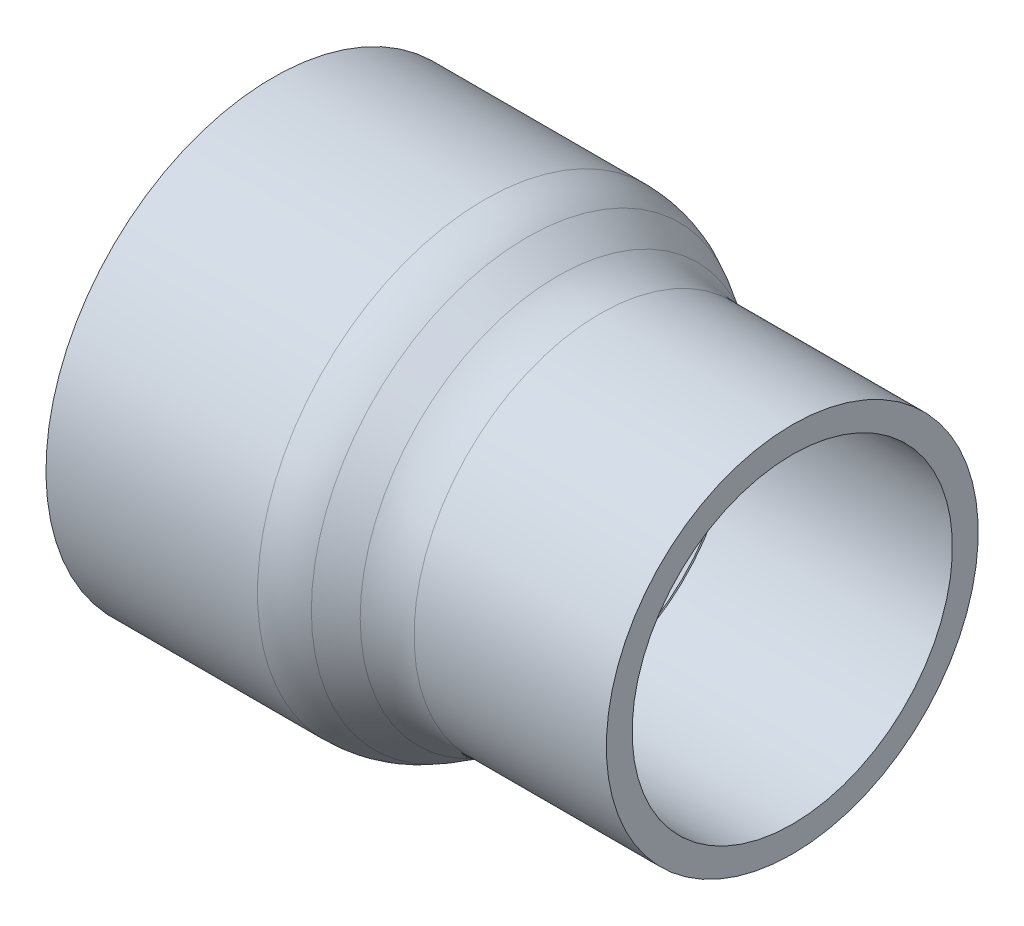
ISO-10303-21;
HEADER;
FILE_DESCRIPTION(('STEP AP214'),'2;1');
FILE_NAME('part.step','',(''),(''),'','','');
FILE_SCHEMA(('AUTOMOTIVE_DESIGN { 1 0 10303 214 1 1 1 1 }'));
ENDSEC;
DATA;
#1=APPLICATION_CONTEXT('core data for automotive mechanical design processes');
#2=APPLICATION_PROTOCOL_DEFINITION('international standard','automotive_design',2000,#1);
#3=PRODUCT_CONTEXT('',#1,'mechanical');
#4=PRODUCT('Part','Part','',(#3));
#5=PRODUCT_RELATED_PRODUCT_CATEGORY('part','',(#4));
#6=PRODUCT_DEFINITION_FORMATION('','',#4);
#7=PRODUCT_DEFINITION_CONTEXT('part definition',#1,'design');
#8=PRODUCT_DEFINITION('design','',#6,#7);
#9=PRODUCT_DEFINITION_SHAPE('','',#8);
#10=(LENGTH_UNIT() NAMED_UNIT(*) SI_UNIT(.MILLI.,.METRE.));
#11=(NAMED_UNIT(*) PLANE_ANGLE_UNIT() SI_UNIT($,.RADIAN.));
#12=(NAMED_UNIT(*) SI_UNIT($,.STERADIAN.) SOLID_ANGLE_UNIT());
#13=UNCERTAINTY_MEASURE_WITH_UNIT(LENGTH_MEASURE(1.E-05),#10,'distance_accuracy_value','');
#14=(GEOMETRIC_REPRESENTATION_CONTEXT(3) GLOBAL_UNCERTAINTY_ASSIGNED_CONTEXT((#13)) GLOBAL_UNIT_ASSIGNED_CONTEXT((#10,
#11,#12)) REPRESENTATION_CONTEXT('',''));
#15=CARTESIAN_POINT('',(0.,0.,0.));
#16=DIRECTION('',(0.,0.,1.));
#17=DIRECTION('',(1.,0.,0.));
#18=AXIS2_PLACEMENT_3D('',#15,#16,#17);
#19=CARTESIAN_POINT('',(-39.37,0.,0.));
#20=DIRECTION('',(-1.,0.,0.));
#21=DIRECTION('',(0.,-1.,0.));
#22=AXIS2_PLACEMENT_3D('',#19,#20,#21);
#23=CYLINDRICAL_SURFACE('',#22,34.417);
#24=CARTESIAN_POINT('',(-7.29610299690509,0.,0.));
#25=DIRECTION('',(1.,0.,0.));
#26=DIRECTION('',(0.,1.,0.));
#27=AXIS2_PLACEMENT_3D('',#24,#25,#26);
#28=CIRCLE('',#27,34.417);
#29=CARTESIAN_POINT('',(-7.29610299690508,34.417,0.));
#30=VERTEX_POINT('',#29);
#31=EDGE_CURVE('E47',#30,#30,#28,.F.);
#32=ORIENTED_EDGE('',*,*,#31,.T.);
#33=EDGE_LOOP('',(#32));
#34=FACE_BOUND('',#33,.T.);
#35=CARTESIAN_POINT('',(-39.37,0.,0.));
#36=DIRECTION('',(-1.,0.,0.));
#37=DIRECTION('',(0.,-1.,0.));
#38=AXIS2_PLACEMENT_3D('',#35,#36,#37);
#39=CIRCLE('',#38,34.417);
#40=CARTESIAN_POINT('',(-39.37,-34.417,0.));
#41=VERTEX_POINT('',#40);
#42=EDGE_CURVE('E52',#41,#41,#39,.T.);
#43=ORIENTED_EDGE('',*,*,#42,.F.);
#44=EDGE_LOOP('',(#43));
#45=FACE_BOUND('',#44,.T.);
#46=ADVANCED_FACE('F32',(#34,#45),#23,.T.);
#47=CARTESIAN_POINT('',(-39.37,-34.417,0.));
#48=DIRECTION('',(-1.,0.,0.));
#49=DIRECTION('',(0.,-1.,0.));
#50=AXIS2_PLACEMENT_3D('',#47,#48,#49);
#51=PLANE('',#50);
#52=ORIENTED_EDGE('',*,*,#42,.T.);
#53=EDGE_LOOP('',(#52));
#54=FACE_BOUND('',#53,.T.);
#55=CARTESIAN_POINT('',(-39.37,0.,0.));
#56=DIRECTION('',(-1.,0.,0.));
#57=DIRECTION('',(0.,-1.,0.));
#58=AXIS2_PLACEMENT_3D('',#55,#56,#57);
#59=CIRCLE('',#58,30.3149);
#60=CARTESIAN_POINT('',(-39.37,-30.3149,0.));
#61=VERTEX_POINT('',#60);
#62=EDGE_CURVE('E55',#61,#61,#59,.T.);
#63=ORIENTED_EDGE('',*,*,#62,.F.);
#64=EDGE_LOOP('',(#63));
#65=FACE_BOUND('',#64,.T.);
#66=ADVANCED_FACE('F91',(#54,#65),#51,.T.);
#67=CARTESIAN_POINT('',(-4.572,0.,0.));
#68=DIRECTION('',(-1.,0.,0.));
#69=DIRECTION('',(0.,-1.,0.));
#70=AXIS2_PLACEMENT_3D('',#67,#68,#69);
#71=CONICAL_SURFACE('',#70,30.0863,0.00656924856536302);
#72=ORIENTED_EDGE('',*,*,#62,.T.);
#73=EDGE_LOOP('',(#72));
#74=FACE_BOUND('',#73,.T.);
#75=CARTESIAN_POINT('',(-4.572,0.,0.));
#76=DIRECTION('',(-1.,0.,0.));
#77=DIRECTION('',(0.,-1.,0.));
#78=AXIS2_PLACEMENT_3D('',#75,#76,#77);
#79=CIRCLE('',#78,30.0863);
#80=CARTESIAN_POINT('',(-4.57200000000001,-30.0863,0.));
#81=VERTEX_POINT('',#80);
#82=EDGE_CURVE('E58',#81,#81,#79,.T.);
#83=ORIENTED_EDGE('',*,*,#82,.F.);
#84=EDGE_LOOP('',(#83));
#85=FACE_BOUND('',#84,.T.);
#86=ADVANCED_FACE('F97',(#74,#85),#71,.F.);
#87=CARTESIAN_POINT('',(5.99981745473317,0.,0.));
#88=DIRECTION('',(-1.,0.,0.));
#89=DIRECTION('',(0.,-1.,0.));
#90=AXIS2_PLACEMENT_3D('',#87,#88,#89);
#91=CONICAL_SURFACE('',#90,23.8897059347466,0.530168024163663);
#92=ORIENTED_EDGE('',*,*,#82,.T.);
#93=EDGE_LOOP('',(#92));
#94=FACE_BOUND('',#93,.T.);
#95=CARTESIAN_POINT('',(5.99981745473317,0.,0.));
#96=DIRECTION('',(-1.,0.,0.));
#97=DIRECTION('',(0.,-1.,0.));
#98=AXIS2_PLACEMENT_3D('',#95,#96,#97);
#99=CIRCLE('',#98,23.8897059347466);
#100=CARTESIAN_POINT('',(5.99981745473317,-23.8897059347466,0.));
#101=VERTEX_POINT('',#100);
#102=EDGE_CURVE('E61',#101,#101,#99,.T.);
#103=ORIENTED_EDGE('',*,*,#102,.F.);
#104=EDGE_LOOP('',(#103));
#105=FACE_BOUND('',#104,.T.);
#106=ADVANCED_FACE('F146',(#94,#105),#91,.F.);
#107=CARTESIAN_POINT('',(6.09600000000001,0.,0.));
#108=DIRECTION('',(1.,0.,0.));
#109=DIRECTION('',(0.,1.,0.));
#110=AXIS2_PLACEMENT_3D('',#107,#108,#109);
#111=CONICAL_SURFACE('',#110,24.0538,1.04062830263124);
#112=ORIENTED_EDGE('',*,*,#102,.T.);
#113=EDGE_LOOP('',(#112));
#114=FACE_BOUND('',#113,.T.);
#115=CARTESIAN_POINT('',(6.09600000000001,0.,0.));
#116=DIRECTION('',(-1.,0.,0.));
#117=DIRECTION('',(0.,-1.,0.));
#118=AXIS2_PLACEMENT_3D('',#115,#116,#117);
#119=CIRCLE('',#118,24.0538);
#120=CARTESIAN_POINT('',(6.09600000000001,-24.0538,0.));
#121=VERTEX_POINT('',#120);
#122=EDGE_CURVE('E64',#121,#121,#119,.T.);
#123=ORIENTED_EDGE('',*,*,#122,.F.);
#124=EDGE_LOOP('',(#123));
#125=FACE_BOUND('',#124,.T.);
#126=ADVANCED_FACE('F87',(#114,#125),#111,.F.);
#127=CARTESIAN_POINT('',(39.37,0.,0.));
#128=DIRECTION('',(1.,0.,0.));
#129=DIRECTION('',(0.,1.,0.));
#130=AXIS2_PLACEMENT_3D('',#127,#128,#129);
#131=CONICAL_SURFACE('',#130,24.2824,0.00687012091898427);
#132=ORIENTED_EDGE('',*,*,#122,.T.);
#133=EDGE_LOOP('',(#132));
#134=FACE_BOUND('',#133,.T.);
#135=CARTESIAN_POINT('',(39.37,0.,0.));
#136=DIRECTION('',(-1.,0.,0.));
#137=DIRECTION('',(0.,-1.,0.));
#138=AXIS2_PLACEMENT_3D('',#135,#136,#137);
#139=CIRCLE('',#138,24.2824);
#140=CARTESIAN_POINT('',(39.37,-24.2824,0.));
#141=VERTEX_POINT('',#140);
#142=EDGE_CURVE('E67',#141,#141,#139,.T.);
#143=ORIENTED_EDGE('',*,*,#142,.F.);
#144=EDGE_LOOP('',(#143));
#145=FACE_BOUND('',#144,.T.);
#146=ADVANCED_FACE('F78',(#134,#145),#131,.F.);
#147=CARTESIAN_POINT('',(39.37,-24.2824,0.));
#148=DIRECTION('',(1.,0.,0.));
#149=DIRECTION('',(0.,1.,0.));
#150=AXIS2_PLACEMENT_3D('',#147,#148,#149);
#151=PLANE('',#150);
#152=ORIENTED_EDGE('',*,*,#142,.T.);
#153=EDGE_LOOP('',(#152));
#154=FACE_BOUND('',#153,.T.);
#155=CARTESIAN_POINT('',(39.37,0.,0.));
#156=DIRECTION('',(-1.,0.,0.));
#157=DIRECTION('',(0.,-1.,0.));
#158=AXIS2_PLACEMENT_3D('',#155,#156,#157);
#159=CIRCLE('',#158,28.194);
#160=CARTESIAN_POINT('',(39.37,-28.194,0.));
#161=VERTEX_POINT('',#160);
#162=EDGE_CURVE('E70',#161,#161,#159,.T.);
#163=ORIENTED_EDGE('',*,*,#162,.F.);
#164=EDGE_LOOP('',(#163));
#165=FACE_BOUND('',#164,.T.);
#166=ADVANCED_FACE('F76',(#154,#165),#151,.T.);
#167=CARTESIAN_POINT('',(-39.37,0.,0.));
#168=DIRECTION('',(-1.,0.,0.));
#169=DIRECTION('',(0.,-1.,0.));
#170=AXIS2_PLACEMENT_3D('',#167,#168,#169);
#171=CYLINDRICAL_SURFACE('',#170,28.194);
#172=CARTESIAN_POINT('',(10.2161728069211,0.,0.));
#173=DIRECTION('',(-1.,0.,0.));
#174=DIRECTION('',(0.,-1.,0.));
#175=AXIS2_PLACEMENT_3D('',#172,#173,#174);
#176=CIRCLE('',#175,28.194);
#177=CARTESIAN_POINT('',(10.2161728069211,-28.194,0.));
#178=VERTEX_POINT('',#177);
#179=EDGE_CURVE('E10',#178,#178,#176,.F.);
#180=ORIENTED_EDGE('',*,*,#179,.T.);
#181=EDGE_LOOP('',(#180));
#182=FACE_BOUND('',#181,.T.);
#183=ORIENTED_EDGE('',*,*,#162,.T.);
#184=EDGE_LOOP('',(#183));
#185=FACE_BOUND('',#184,.T.);
#186=ADVANCED_FACE('F74',(#182,#185),#171,.T.);
#187=CARTESIAN_POINT('',(-3.84839899658513,0.,0.));
#188=DIRECTION('',(-1.,0.,0.));
#189=DIRECTION('',(0.,-1.,0.));
#190=AXIS2_PLACEMENT_3D('',#187,#188,#189);
#191=CONICAL_SURFACE('',#190,34.417,0.530168024163664);
#192=CARTESIAN_POINT('',(-0.873988504298546,0.,0.));
#193=DIRECTION('',(1.,0.,0.));
#194=DIRECTION('',(0.,1.,0.));
#195=AXIS2_PLACEMENT_3D('',#192,#193,#194);
#196=CIRCLE('',#195,32.6735708797896);
#197=CARTESIAN_POINT('',(-0.873988504298539,32.6735708797896,0.));
#198=VERTEX_POINT('',#197);
#199=EDGE_CURVE('E39',#198,#198,#196,.T.);
#200=ORIENTED_EDGE('',*,*,#199,.T.);
#201=EDGE_LOOP('',(#200));
#202=FACE_BOUND('',#201,.T.);
#203=CARTESIAN_POINT('',(3.79405831431457,0.,0.));
#204=DIRECTION('',(-1.,0.,0.));
#205=DIRECTION('',(0.,-1.,0.));
#206=AXIS2_PLACEMENT_3D('',#203,#204,#205);
#207=CIRCLE('',#206,29.9374291202104);
#208=CARTESIAN_POINT('',(3.79405831431457,-29.9374291202104,0.));
#209=VERTEX_POINT('',#208);
#210=EDGE_CURVE('E43',#209,#209,#207,.T.);
#211=ORIENTED_EDGE('',*,*,#210,.T.);
#212=EDGE_LOOP('',(#211));
#213=FACE_BOUND('',#212,.T.);
#214=ADVANCED_FACE('F85',(#202,#213),#191,.T.);
#215=CARTESIAN_POINT('',(-7.29610299690509,0.,0.));
#216=DIRECTION('',(1.,0.,0.));
#217=DIRECTION('',(0.,1.,0.));
#218=AXIS2_PLACEMENT_3D('',#215,#216,#217);
#219=TOROIDAL_SURFACE('',#218,21.717,12.7);
#220=ORIENTED_EDGE('',*,*,#199,.F.);
#221=EDGE_LOOP('',(#220));
#222=FACE_BOUND('',#221,.T.);
#223=ORIENTED_EDGE('',*,*,#31,.F.);
#224=EDGE_LOOP('',(#223));
#225=FACE_BOUND('',#224,.T.);
#226=ADVANCED_FACE('F102',(#222,#225),#219,.T.);
#227=CARTESIAN_POINT('',(10.2161728069211,0.,0.));
#228=DIRECTION('',(-1.,0.,0.));
#229=DIRECTION('',(0.,-1.,0.));
#230=AXIS2_PLACEMENT_3D('',#227,#228,#229);
#231=TOROIDAL_SURFACE('',#230,40.894,12.7);
#232=ORIENTED_EDGE('',*,*,#179,.F.);
#233=EDGE_LOOP('',(#232));
#234=FACE_BOUND('',#233,.T.);
#235=ORIENTED_EDGE('',*,*,#210,.F.);
#236=EDGE_LOOP('',(#235));
#237=FACE_BOUND('',#236,.T.);
#238=ADVANCED_FACE('F34',(#234,#237),#231,.F.);
#239=CLOSED_SHELL('',(#46,#66,#86,#106,#126,#146,#166,#186,#214,#226,#238));
#240=MANIFOLD_SOLID_BREP('B2',#239);
#241=ADVANCED_BREP_SHAPE_REPRESENTATION('',(#18,#240),#14);
#242=SHAPE_DEFINITION_REPRESENTATION(#9,#241);
ENDSEC;
END-ISO-10303-21;
